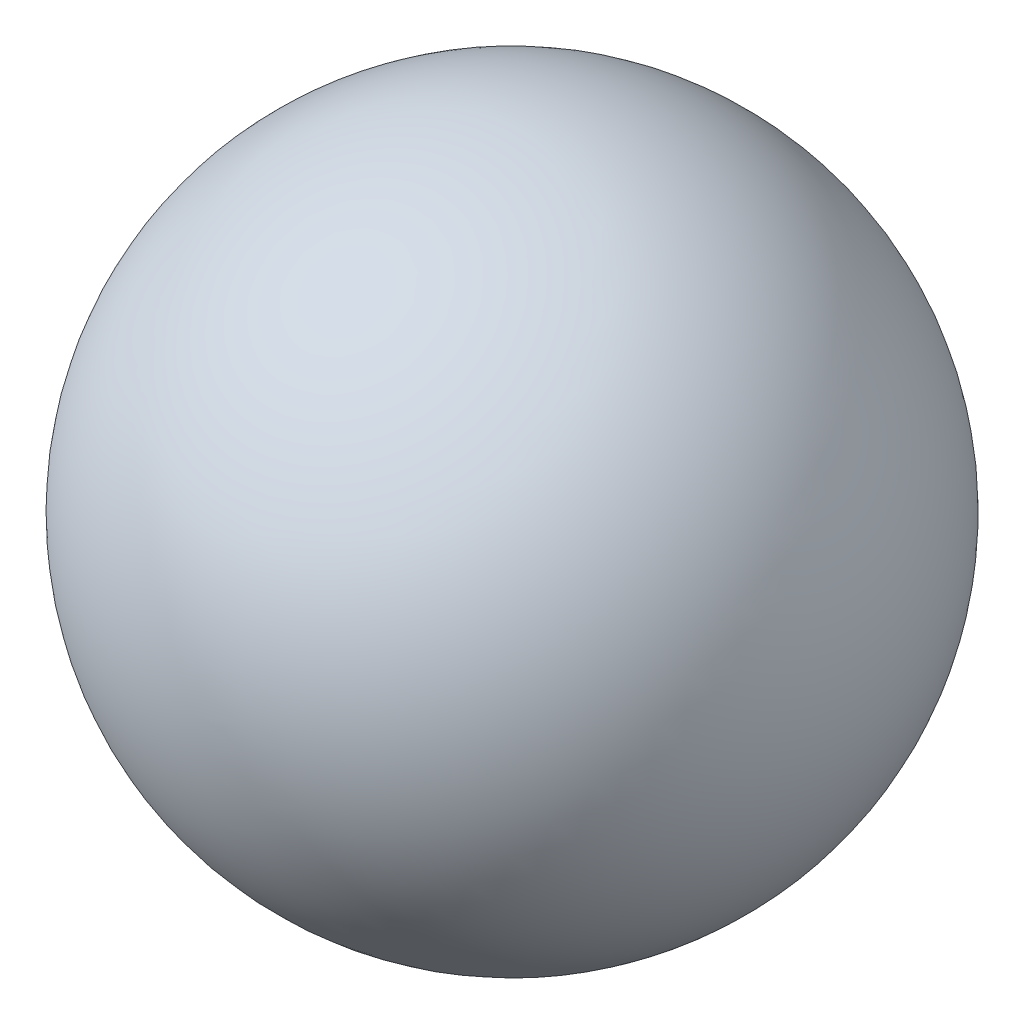
ISO-10303-21;
HEADER;
FILE_DESCRIPTION(('STEP AP214'),'2;1');
FILE_NAME('part.step','',(''),(''),'','','');
FILE_SCHEMA(('AUTOMOTIVE_DESIGN { 1 0 10303 214 1 1 1 1 }'));
ENDSEC;
DATA;
#1=APPLICATION_CONTEXT('core data for automotive mechanical design processes');
#2=APPLICATION_PROTOCOL_DEFINITION('international standard','automotive_design',2000,#1);
#3=PRODUCT_CONTEXT('',#1,'mechanical');
#4=PRODUCT('Part','Part','',(#3));
#5=PRODUCT_RELATED_PRODUCT_CATEGORY('part','',(#4));
#6=PRODUCT_DEFINITION_FORMATION('','',#4);
#7=PRODUCT_DEFINITION_CONTEXT('part definition',#1,'design');
#8=PRODUCT_DEFINITION('design','',#6,#7);
#9=PRODUCT_DEFINITION_SHAPE('','',#8);
#10=(LENGTH_UNIT() NAMED_UNIT(*) SI_UNIT(.MILLI.,.METRE.));
#11=(NAMED_UNIT(*) PLANE_ANGLE_UNIT() SI_UNIT($,.RADIAN.));
#12=(NAMED_UNIT(*) SI_UNIT($,.STERADIAN.) SOLID_ANGLE_UNIT());
#13=UNCERTAINTY_MEASURE_WITH_UNIT(LENGTH_MEASURE(1.E-05),#10,'distance_accuracy_value','');
#14=(GEOMETRIC_REPRESENTATION_CONTEXT(3) GLOBAL_UNCERTAINTY_ASSIGNED_CONTEXT((#13)) GLOBAL_UNIT_ASSIGNED_CONTEXT((#10,
#11,#12)) REPRESENTATION_CONTEXT('',''));
#15=CARTESIAN_POINT('',(0.,0.,0.));
#16=DIRECTION('',(0.,0.,1.));
#17=DIRECTION('',(1.,0.,0.));
#18=AXIS2_PLACEMENT_3D('',#15,#16,#17);
#19=CARTESIAN_POINT('',(49.75,49.7825737076513,18.1835737766882));
#20=DIRECTION('',(0.,0.939302704886863,0.343089534367085));
#21=DIRECTION('',(0.173648177666933,-0.337877233422054,0.92503258619792));
#22=AXIS2_PLACEMENT_3D('',#19,#20,#21);
#23=SPHERICAL_SURFACE('',#22,5.95);
#24=CARTESIAN_POINT('',(49.75,44.1937226135745,16.142191047204));
#25=VERTEX_POINT('',#24);
#26=VERTEX_LOOP('',#25);
#27=FACE_BOUND('',#26,.T.);
#28=CARTESIAN_POINT('',(49.75,55.3714248017281,20.2249565061724));
#29=VERTEX_POINT('',#28);
#30=VERTEX_LOOP('',#29);
#31=FACE_BOUND('',#30,.T.);
#32=ADVANCED_FACE('F16',(#27,#31),#23,.T.);
#33=CLOSED_SHELL('',(#32));
#34=MANIFOLD_SOLID_BREP('B1',#33);
#35=ADVANCED_BREP_SHAPE_REPRESENTATION('',(#18,#34),#14);
#36=SHAPE_DEFINITION_REPRESENTATION(#9,#35);
ENDSEC;
END-ISO-10303-21;
